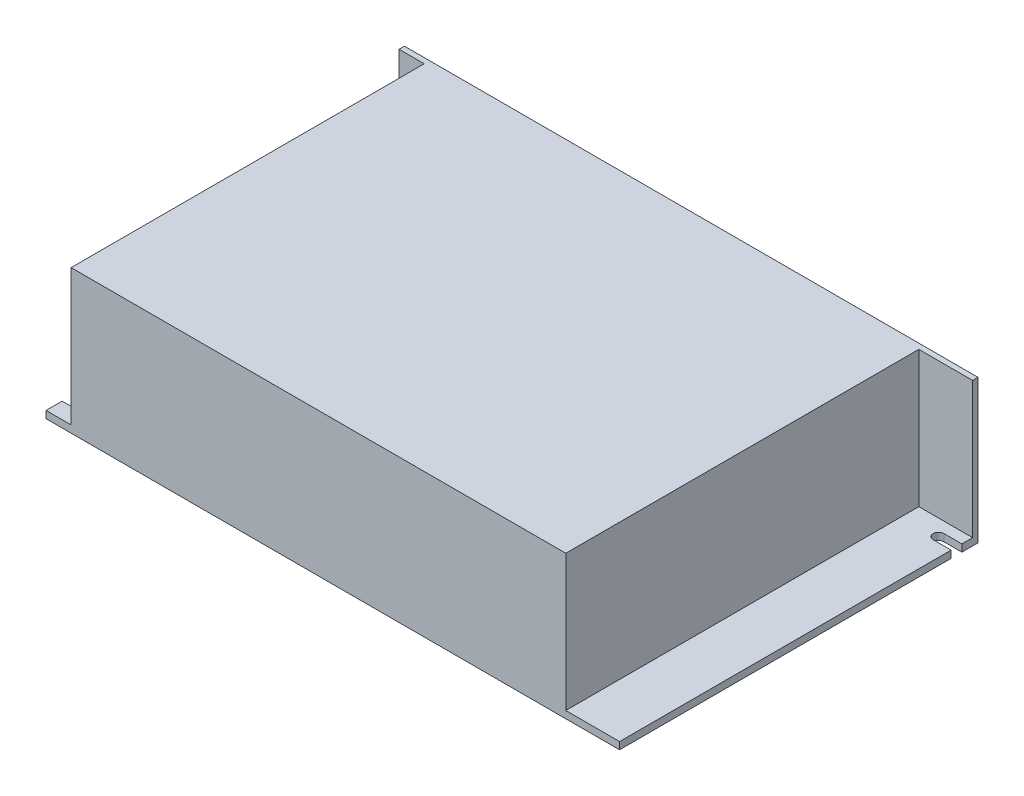
ISO-10303-21;
HEADER;
FILE_DESCRIPTION(('STEP AP214'),'2;1');
FILE_NAME('part.step','',(''),(''),'','','');
FILE_SCHEMA(('AUTOMOTIVE_DESIGN { 1 0 10303 214 1 1 1 1 }'));
ENDSEC;
DATA;
#1=APPLICATION_CONTEXT('core data for automotive mechanical design processes');
#2=APPLICATION_PROTOCOL_DEFINITION('international standard','automotive_design',2000,#1);
#3=PRODUCT_CONTEXT('',#1,'mechanical');
#4=PRODUCT('Part','Part','',(#3));
#5=PRODUCT_RELATED_PRODUCT_CATEGORY('part','',(#4));
#6=PRODUCT_DEFINITION_FORMATION('','',#4);
#7=PRODUCT_DEFINITION_CONTEXT('part definition',#1,'design');
#8=PRODUCT_DEFINITION('design','',#6,#7);
#9=PRODUCT_DEFINITION_SHAPE('','',#8);
#10=(LENGTH_UNIT() NAMED_UNIT(*) SI_UNIT(.MILLI.,.METRE.));
#11=(NAMED_UNIT(*) PLANE_ANGLE_UNIT() SI_UNIT($,.RADIAN.));
#12=(NAMED_UNIT(*) SI_UNIT($,.STERADIAN.) SOLID_ANGLE_UNIT());
#13=UNCERTAINTY_MEASURE_WITH_UNIT(LENGTH_MEASURE(1.E-05),#10,'distance_accuracy_value','');
#14=(GEOMETRIC_REPRESENTATION_CONTEXT(3) GLOBAL_UNCERTAINTY_ASSIGNED_CONTEXT((#13)) GLOBAL_UNIT_ASSIGNED_CONTEXT((#10,
#11,#12)) REPRESENTATION_CONTEXT('',''));
#15=CARTESIAN_POINT('',(0.,0.,0.));
#16=DIRECTION('',(0.,0.,1.));
#17=DIRECTION('',(1.,0.,0.));
#18=AXIS2_PLACEMENT_3D('',#15,#16,#17);
#19=CARTESIAN_POINT('',(80.,-20.,100.));
#20=DIRECTION('',(-1.,0.,0.));
#21=DIRECTION('',(0.,0.,1.));
#22=AXIS2_PLACEMENT_3D('',#19,#20,#21);
#23=PLANE('',#22);
#24=DIRECTION('',(0.,0.,-1.));
#25=VECTOR('',#24,1.);
#26=CARTESIAN_POINT('',(80.,-20.,100.));
#27=LINE('',#26,#25);
#28=CARTESIAN_POINT('',(80.,-20.,100.));
#29=VERTEX_POINT('',#28);
#30=CARTESIAN_POINT('',(80.,-20.,7.5));
#31=VERTEX_POINT('',#30);
#32=EDGE_CURVE('E188',#29,#31,#27,.T.);
#33=ORIENTED_EDGE('',*,*,#32,.T.);
#34=DIRECTION('',(0.,1.,0.));
#35=VECTOR('',#34,1.);
#36=CARTESIAN_POINT('',(80.,-20.,7.5));
#37=LINE('',#36,#35);
#38=CARTESIAN_POINT('',(80.,-18.,7.5));
#39=VERTEX_POINT('',#38);
#40=EDGE_CURVE('E248',#31,#39,#37,.T.);
#41=ORIENTED_EDGE('',*,*,#40,.T.);
#42=DIRECTION('',(0.,0.,1.));
#43=VECTOR('',#42,1.);
#44=CARTESIAN_POINT('',(80.,-18.,1.5));
#45=LINE('',#44,#43);
#46=CARTESIAN_POINT('',(80.,-18.,100.));
#47=VERTEX_POINT('',#46);
#48=EDGE_CURVE('E250',#39,#47,#45,.T.);
#49=ORIENTED_EDGE('',*,*,#48,.T.);
#50=DIRECTION('',(0.,1.,0.));
#51=VECTOR('',#50,1.);
#52=CARTESIAN_POINT('',(80.,-20.,100.));
#53=LINE('',#52,#51);
#54=EDGE_CURVE('E222',#29,#47,#53,.T.);
#55=ORIENTED_EDGE('',*,*,#54,.F.);
#56=EDGE_LOOP('',(#33,#41,#49,#55));
#57=FACE_BOUND('',#56,.T.);
#58=ADVANCED_FACE('F40',(#57),#23,.F.);
#59=CARTESIAN_POINT('',(-80.,-20.,100.));
#60=DIRECTION('',(1.,0.,0.));
#61=DIRECTION('',(0.,0.,-1.));
#62=AXIS2_PLACEMENT_3D('',#59,#60,#61);
#63=PLANE('',#62);
#64=DIRECTION('',(0.,0.,-1.));
#65=VECTOR('',#64,1.);
#66=CARTESIAN_POINT('',(-80.,-20.,100.));
#67=LINE('',#66,#65);
#68=CARTESIAN_POINT('',(-80.,-20.,92.5));
#69=VERTEX_POINT('',#68);
#70=CARTESIAN_POINT('',(-80.,-20.,0.));
#71=VERTEX_POINT('',#70);
#72=EDGE_CURVE('E192',#69,#71,#67,.T.);
#73=ORIENTED_EDGE('',*,*,#72,.F.);
#74=DIRECTION('',(0.,1.,0.));
#75=VECTOR('',#74,1.);
#76=CARTESIAN_POINT('',(-80.,-20.,92.5));
#77=LINE('',#76,#75);
#78=CARTESIAN_POINT('',(-80.,-18.,92.5));
#79=VERTEX_POINT('',#78);
#80=EDGE_CURVE('E280',#69,#79,#77,.T.);
#81=ORIENTED_EDGE('',*,*,#80,.T.);
#82=DIRECTION('',(0.,0.,-1.));
#83=VECTOR('',#82,1.);
#84=CARTESIAN_POINT('',(-80.,-18.,1.5));
#85=LINE('',#84,#83);
#86=CARTESIAN_POINT('',(-80.,-18.,1.5));
#87=VERTEX_POINT('',#86);
#88=EDGE_CURVE('E270',#79,#87,#85,.T.);
#89=ORIENTED_EDGE('',*,*,#88,.T.);
#90=DIRECTION('',(0.,1.,0.));
#91=VECTOR('',#90,1.);
#92=CARTESIAN_POINT('',(-80.,-119.635586012228,1.5));
#93=LINE('',#92,#91);
#94=CARTESIAN_POINT('',(-80.,20.,1.5));
#95=VERTEX_POINT('',#94);
#96=EDGE_CURVE('E210',#87,#95,#93,.T.);
#97=ORIENTED_EDGE('',*,*,#96,.T.);
#98=DIRECTION('',(0.,0.,-1.));
#99=VECTOR('',#98,1.);
#100=CARTESIAN_POINT('',(-80.,20.,100.));
#101=LINE('',#100,#99);
#102=CARTESIAN_POINT('',(-80.,20.,0.));
#103=VERTEX_POINT('',#102);
#104=EDGE_CURVE('E48',#95,#103,#101,.T.);
#105=ORIENTED_EDGE('',*,*,#104,.T.);
#106=DIRECTION('',(0.,-1.,0.));
#107=VECTOR('',#106,1.);
#108=CARTESIAN_POINT('',(-80.,-20.,0.));
#109=LINE('',#108,#107);
#110=EDGE_CURVE('E208',#103,#71,#109,.T.);
#111=ORIENTED_EDGE('',*,*,#110,.T.);
#112=EDGE_LOOP('',(#73,#81,#89,#97,#105,#111));
#113=FACE_BOUND('',#112,.T.);
#114=ADVANCED_FACE('F206',(#113),#63,.F.);
#115=CARTESIAN_POINT('',(80.,-18.,1.5));
#116=VERTEX_POINT('',#115);
#117=CARTESIAN_POINT('',(80.,-18.,4.5));
#118=VERTEX_POINT('',#117);
#119=EDGE_CURVE('E181',#116,#118,#45,.T.);
#120=ORIENTED_EDGE('',*,*,#119,.T.);
#121=DIRECTION('',(0.,1.,0.));
#122=VECTOR('',#121,1.);
#123=CARTESIAN_POINT('',(80.,-20.,4.5));
#124=LINE('',#123,#122);
#125=CARTESIAN_POINT('',(80.,-20.,4.5));
#126=VERTEX_POINT('',#125);
#127=EDGE_CURVE('E55',#126,#118,#124,.T.);
#128=ORIENTED_EDGE('',*,*,#127,.F.);
#129=CARTESIAN_POINT('',(80.,-20.,0.));
#130=VERTEX_POINT('',#129);
#131=EDGE_CURVE('E177',#126,#130,#27,.T.);
#132=ORIENTED_EDGE('',*,*,#131,.T.);
#133=DIRECTION('',(0.,1.,0.));
#134=VECTOR('',#133,1.);
#135=CARTESIAN_POINT('',(80.,-20.,0.));
#136=LINE('',#135,#134);
#137=CARTESIAN_POINT('',(80.,20.,0.));
#138=VERTEX_POINT('',#137);
#139=EDGE_CURVE('E219',#130,#138,#136,.T.);
#140=ORIENTED_EDGE('',*,*,#139,.T.);
#141=DIRECTION('',(0.,0.,-1.));
#142=VECTOR('',#141,1.);
#143=CARTESIAN_POINT('',(80.,20.,100.));
#144=LINE('',#143,#142);
#145=CARTESIAN_POINT('',(80.,20.,1.5));
#146=VERTEX_POINT('',#145);
#147=EDGE_CURVE('E12',#146,#138,#144,.T.);
#148=ORIENTED_EDGE('',*,*,#147,.F.);
#149=DIRECTION('',(0.,1.,0.));
#150=VECTOR('',#149,1.);
#151=CARTESIAN_POINT('',(80.,-119.635586012228,1.5));
#152=LINE('',#151,#150);
#153=EDGE_CURVE('E235',#116,#146,#152,.T.);
#154=ORIENTED_EDGE('',*,*,#153,.F.);
#155=EDGE_LOOP('',(#120,#128,#132,#140,#148,#154));
#156=FACE_BOUND('',#155,.T.);
#157=ADVANCED_FACE('F42',(#156),#23,.F.);
#158=CARTESIAN_POINT('',(-80.,20.,100.));
#159=DIRECTION('',(0.,-1.,0.));
#160=DIRECTION('',(0.,0.,-1.));
#161=AXIS2_PLACEMENT_3D('',#158,#159,#160);
#162=PLANE('',#161);
#163=ORIENTED_EDGE('',*,*,#104,.F.);
#164=DIRECTION('',(-1.,0.,0.));
#165=VECTOR('',#164,1.);
#166=CARTESIAN_POINT('',(-80.,20.,1.5));
#167=LINE('',#166,#165);
#168=CARTESIAN_POINT('',(-73.,20.,1.5));
#169=VERTEX_POINT('',#168);
#170=EDGE_CURVE('E261',#169,#95,#167,.T.);
#171=ORIENTED_EDGE('',*,*,#170,.F.);
#172=DIRECTION('',(0.,0.,-1.));
#173=VECTOR('',#172,1.);
#174=CARTESIAN_POINT('',(-73.,20.,1.5));
#175=LINE('',#174,#173);
#176=CARTESIAN_POINT('',(-73.,20.,100.));
#177=VERTEX_POINT('',#176);
#178=EDGE_CURVE('E234',#177,#169,#175,.T.);
#179=ORIENTED_EDGE('',*,*,#178,.F.);
#180=DIRECTION('',(-1.,0.,0.));
#181=VECTOR('',#180,1.);
#182=CARTESIAN_POINT('',(-80.,20.,100.));
#183=LINE('',#182,#181);
#184=CARTESIAN_POINT('',(65.,20.,100.));
#185=VERTEX_POINT('',#184);
#186=EDGE_CURVE('E227',#185,#177,#183,.T.);
#187=ORIENTED_EDGE('',*,*,#186,.F.);
#188=DIRECTION('',(0.,0.,1.));
#189=VECTOR('',#188,1.);
#190=CARTESIAN_POINT('',(65.,20.,1.5));
#191=LINE('',#190,#189);
#192=CARTESIAN_POINT('',(65.,20.,1.5));
#193=VERTEX_POINT('',#192);
#194=EDGE_CURVE('E238',#193,#185,#191,.T.);
#195=ORIENTED_EDGE('',*,*,#194,.F.);
#196=DIRECTION('',(-1.,0.,0.));
#197=VECTOR('',#196,1.);
#198=CARTESIAN_POINT('',(80.,20.,1.5));
#199=LINE('',#198,#197);
#200=EDGE_CURVE('E245',#146,#193,#199,.T.);
#201=ORIENTED_EDGE('',*,*,#200,.F.);
#202=ORIENTED_EDGE('',*,*,#147,.T.);
#203=DIRECTION('',(-1.,0.,0.));
#204=VECTOR('',#203,1.);
#205=CARTESIAN_POINT('',(-80.,20.,0.));
#206=LINE('',#205,#204);
#207=EDGE_CURVE('E214',#138,#103,#206,.T.);
#208=ORIENTED_EDGE('',*,*,#207,.T.);
#209=EDGE_LOOP('',(#163,#171,#179,#187,#195,#201,#202,#208));
#210=FACE_BOUND('',#209,.T.);
#211=ADVANCED_FACE('F215',(#210),#162,.F.);
#212=CARTESIAN_POINT('',(-80.,-18.,100.));
#213=VERTEX_POINT('',#212);
#214=CARTESIAN_POINT('',(-80.,-18.,95.5));
#215=VERTEX_POINT('',#214);
#216=EDGE_CURVE('E257',#213,#215,#85,.T.);
#217=ORIENTED_EDGE('',*,*,#216,.T.);
#218=DIRECTION('',(0.,1.,0.));
#219=VECTOR('',#218,1.);
#220=CARTESIAN_POINT('',(-80.,-20.,95.5));
#221=LINE('',#220,#219);
#222=CARTESIAN_POINT('',(-80.,-20.,95.5));
#223=VERTEX_POINT('',#222);
#224=EDGE_CURVE('E63',#223,#215,#221,.T.);
#225=ORIENTED_EDGE('',*,*,#224,.F.);
#226=CARTESIAN_POINT('',(-80.,-20.,100.));
#227=VERTEX_POINT('',#226);
#228=EDGE_CURVE('E198',#227,#223,#67,.T.);
#229=ORIENTED_EDGE('',*,*,#228,.F.);
#230=DIRECTION('',(0.,-1.,0.));
#231=VECTOR('',#230,1.);
#232=CARTESIAN_POINT('',(-80.,-20.,100.));
#233=LINE('',#232,#231);
#234=EDGE_CURVE('E193',#213,#227,#233,.T.);
#235=ORIENTED_EDGE('',*,*,#234,.F.);
#236=EDGE_LOOP('',(#217,#225,#229,#235));
#237=FACE_BOUND('',#236,.T.);
#238=ADVANCED_FACE('F333',(#237),#63,.F.);
#239=CARTESIAN_POINT('',(-80.,-20.,100.));
#240=DIRECTION('',(0.,1.,0.));
#241=DIRECTION('',(0.,0.,1.));
#242=AXIS2_PLACEMENT_3D('',#239,#240,#241);
#243=PLANE('',#242);
#244=CARTESIAN_POINT('',(75.,-20.,6.));
#245=DIRECTION('',(0.,1.,0.));
#246=DIRECTION('',(0.,0.,1.));
#247=AXIS2_PLACEMENT_3D('',#244,#245,#246);
#248=CIRCLE('',#247,1.5);
#249=CARTESIAN_POINT('',(75.,-20.,4.5));
#250=VERTEX_POINT('',#249);
#251=CARTESIAN_POINT('',(75.,-20.,7.5));
#252=VERTEX_POINT('',#251);
#253=EDGE_CURVE('E171',#250,#252,#248,.T.);
#254=ORIENTED_EDGE('',*,*,#253,.T.);
#255=DIRECTION('',(1.,0.,0.));
#256=VECTOR('',#255,1.);
#257=CARTESIAN_POINT('',(75.,-20.,7.5));
#258=LINE('',#257,#256);
#259=EDGE_CURVE('E182',#252,#31,#258,.T.);
#260=ORIENTED_EDGE('',*,*,#259,.T.);
#261=ORIENTED_EDGE('',*,*,#32,.F.);
#262=DIRECTION('',(1.,0.,0.));
#263=VECTOR('',#262,1.);
#264=CARTESIAN_POINT('',(-80.,-20.,100.));
#265=LINE('',#264,#263);
#266=EDGE_CURVE('E189',#227,#29,#265,.T.);
#267=ORIENTED_EDGE('',*,*,#266,.F.);
#268=ORIENTED_EDGE('',*,*,#228,.T.);
#269=DIRECTION('',(1.,0.,0.));
#270=VECTOR('',#269,1.);
#271=CARTESIAN_POINT('',(-75.,-20.,95.5));
#272=LINE('',#271,#270);
#273=CARTESIAN_POINT('',(-75.,-20.,95.5));
#274=VERTEX_POINT('',#273);
#275=EDGE_CURVE('E286',#223,#274,#272,.T.);
#276=ORIENTED_EDGE('',*,*,#275,.T.);
#277=CARTESIAN_POINT('',(-75.,-20.,94.));
#278=DIRECTION('',(0.,1.,0.));
#279=DIRECTION('',(0.,0.,-1.));
#280=AXIS2_PLACEMENT_3D('',#277,#278,#279);
#281=CIRCLE('',#280,1.5);
#282=CARTESIAN_POINT('',(-75.,-20.,92.5));
#283=VERTEX_POINT('',#282);
#284=EDGE_CURVE('E294',#274,#283,#281,.T.);
#285=ORIENTED_EDGE('',*,*,#284,.T.);
#286=DIRECTION('',(-1.,0.,0.));
#287=VECTOR('',#286,1.);
#288=CARTESIAN_POINT('',(-80.,-20.,92.5));
#289=LINE('',#288,#287);
#290=EDGE_CURVE('E276',#283,#69,#289,.T.);
#291=ORIENTED_EDGE('',*,*,#290,.T.);
#292=ORIENTED_EDGE('',*,*,#72,.T.);
#293=DIRECTION('',(1.,0.,0.));
#294=VECTOR('',#293,1.);
#295=CARTESIAN_POINT('',(-80.,-20.,0.));
#296=LINE('',#295,#294);
#297=EDGE_CURVE('E186',#71,#130,#296,.T.);
#298=ORIENTED_EDGE('',*,*,#297,.T.);
#299=ORIENTED_EDGE('',*,*,#131,.F.);
#300=DIRECTION('',(-1.,0.,0.));
#301=VECTOR('',#300,1.);
#302=CARTESIAN_POINT('',(80.,-20.,4.5));
#303=LINE('',#302,#301);
#304=EDGE_CURVE('E164',#126,#250,#303,.T.);
#305=ORIENTED_EDGE('',*,*,#304,.T.);
#306=EDGE_LOOP('',(#254,#260,#261,#267,#268,#276,#285,#291,#292,#298,#299,#305));
#307=FACE_BOUND('',#306,.T.);
#308=ADVANCED_FACE('F184',(#307),#243,.F.);
#309=CARTESIAN_POINT('',(0.,0.,100.));
#310=DIRECTION('',(0.,0.,-1.));
#311=DIRECTION('',(-1.,0.,0.));
#312=AXIS2_PLACEMENT_3D('',#309,#310,#311);
#313=PLANE('',#312);
#314=ORIENTED_EDGE('',*,*,#186,.T.);
#315=DIRECTION('',(0.,1.,0.));
#316=VECTOR('',#315,1.);
#317=CARTESIAN_POINT('',(-73.,-119.635586012228,100.));
#318=LINE('',#317,#316);
#319=CARTESIAN_POINT('',(-73.,-18.,100.));
#320=VERTEX_POINT('',#319);
#321=EDGE_CURVE('E258',#320,#177,#318,.T.);
#322=ORIENTED_EDGE('',*,*,#321,.F.);
#323=DIRECTION('',(-1.,0.,0.));
#324=VECTOR('',#323,1.);
#325=CARTESIAN_POINT('',(-80.,-18.,100.));
#326=LINE('',#325,#324);
#327=EDGE_CURVE('E224',#320,#213,#326,.T.);
#328=ORIENTED_EDGE('',*,*,#327,.T.);
#329=ORIENTED_EDGE('',*,*,#234,.T.);
#330=ORIENTED_EDGE('',*,*,#266,.T.);
#331=ORIENTED_EDGE('',*,*,#54,.T.);
#332=DIRECTION('',(-1.,0.,0.));
#333=VECTOR('',#332,1.);
#334=CARTESIAN_POINT('',(80.,-18.,100.));
#335=LINE('',#334,#333);
#336=CARTESIAN_POINT('',(65.,-18.,100.));
#337=VERTEX_POINT('',#336);
#338=EDGE_CURVE('E251',#47,#337,#335,.T.);
#339=ORIENTED_EDGE('',*,*,#338,.T.);
#340=DIRECTION('',(0.,1.,0.));
#341=VECTOR('',#340,1.);
#342=CARTESIAN_POINT('',(65.,-119.635586012228,100.));
#343=LINE('',#342,#341);
#344=EDGE_CURVE('E240',#337,#185,#343,.T.);
#345=ORIENTED_EDGE('',*,*,#344,.T.);
#346=EDGE_LOOP('',(#314,#322,#328,#329,#330,#331,#339,#345));
#347=FACE_BOUND('',#346,.T.);
#348=ADVANCED_FACE('F328',(#347),#313,.F.);
#349=CARTESIAN_POINT('',(0.,0.,0.));
#350=DIRECTION('',(0.,0.,-1.));
#351=DIRECTION('',(-1.,0.,0.));
#352=AXIS2_PLACEMENT_3D('',#349,#350,#351);
#353=PLANE('',#352);
#354=ORIENTED_EDGE('',*,*,#139,.F.);
#355=ORIENTED_EDGE('',*,*,#297,.F.);
#356=ORIENTED_EDGE('',*,*,#110,.F.);
#357=ORIENTED_EDGE('',*,*,#207,.F.);
#358=EDGE_LOOP('',(#354,#355,#356,#357));
#359=FACE_BOUND('',#358,.T.);
#360=ADVANCED_FACE('F221',(#359),#353,.T.);
#361=CARTESIAN_POINT('',(65.,-119.635586012228,1.5));
#362=DIRECTION('',(-1.,0.,0.));
#363=DIRECTION('',(0.,0.,1.));
#364=AXIS2_PLACEMENT_3D('',#361,#362,#363);
#365=PLANE('',#364);
#366=DIRECTION('',(0.,0.,-1.));
#367=VECTOR('',#366,1.);
#368=CARTESIAN_POINT('',(65.,-18.,1.5));
#369=LINE('',#368,#367);
#370=CARTESIAN_POINT('',(65.,-18.,1.5));
#371=VERTEX_POINT('',#370);
#372=EDGE_CURVE('E243',#337,#371,#369,.T.);
#373=ORIENTED_EDGE('',*,*,#372,.T.);
#374=DIRECTION('',(0.,1.,0.));
#375=VECTOR('',#374,1.);
#376=CARTESIAN_POINT('',(65.,-119.635586012228,1.5));
#377=LINE('',#376,#375);
#378=EDGE_CURVE('E237',#371,#193,#377,.T.);
#379=ORIENTED_EDGE('',*,*,#378,.T.);
#380=ORIENTED_EDGE('',*,*,#194,.T.);
#381=ORIENTED_EDGE('',*,*,#344,.F.);
#382=EDGE_LOOP('',(#373,#379,#380,#381));
#383=FACE_BOUND('',#382,.T.);
#384=ADVANCED_FACE('F387',(#383),#365,.F.);
#385=CARTESIAN_POINT('',(80.,-119.635586012228,1.5));
#386=DIRECTION('',(0.,0.,-1.));
#387=DIRECTION('',(-1.,0.,0.));
#388=AXIS2_PLACEMENT_3D('',#385,#386,#387);
#389=PLANE('',#388);
#390=DIRECTION('',(1.,0.,0.));
#391=VECTOR('',#390,1.);
#392=CARTESIAN_POINT('',(80.,-18.,1.5));
#393=LINE('',#392,#391);
#394=EDGE_CURVE('E232',#371,#116,#393,.T.);
#395=ORIENTED_EDGE('',*,*,#394,.T.);
#396=ORIENTED_EDGE('',*,*,#153,.T.);
#397=ORIENTED_EDGE('',*,*,#200,.T.);
#398=ORIENTED_EDGE('',*,*,#378,.F.);
#399=EDGE_LOOP('',(#395,#396,#397,#398));
#400=FACE_BOUND('',#399,.T.);
#401=ADVANCED_FACE('F389',(#400),#389,.F.);
#402=CARTESIAN_POINT('',(-80.,-18.,100.));
#403=DIRECTION('',(0.,1.,0.));
#404=DIRECTION('',(0.,0.,1.));
#405=AXIS2_PLACEMENT_3D('',#402,#403,#404);
#406=PLANE('',#405);
#407=DIRECTION('',(1.,0.,0.));
#408=VECTOR('',#407,1.);
#409=CARTESIAN_POINT('',(75.,-18.,7.5));
#410=LINE('',#409,#408);
#411=CARTESIAN_POINT('',(75.,-18.,7.5));
#412=VERTEX_POINT('',#411);
#413=EDGE_CURVE('E172',#412,#39,#410,.T.);
#414=ORIENTED_EDGE('',*,*,#413,.F.);
#415=CARTESIAN_POINT('',(75.,-18.,6.));
#416=DIRECTION('',(0.,1.,0.));
#417=DIRECTION('',(0.,0.,1.));
#418=AXIS2_PLACEMENT_3D('',#415,#416,#417);
#419=CIRCLE('',#418,1.5);
#420=CARTESIAN_POINT('',(75.,-18.,4.5));
#421=VERTEX_POINT('',#420);
#422=EDGE_CURVE('E305',#421,#412,#419,.T.);
#423=ORIENTED_EDGE('',*,*,#422,.F.);
#424=DIRECTION('',(-1.,0.,0.));
#425=VECTOR('',#424,1.);
#426=CARTESIAN_POINT('',(80.,-18.,4.5));
#427=LINE('',#426,#425);
#428=EDGE_CURVE('E283',#118,#421,#427,.T.);
#429=ORIENTED_EDGE('',*,*,#428,.F.);
#430=ORIENTED_EDGE('',*,*,#119,.F.);
#431=ORIENTED_EDGE('',*,*,#394,.F.);
#432=ORIENTED_EDGE('',*,*,#372,.F.);
#433=ORIENTED_EDGE('',*,*,#338,.F.);
#434=ORIENTED_EDGE('',*,*,#48,.F.);
#435=EDGE_LOOP('',(#414,#423,#429,#430,#431,#432,#433,#434));
#436=FACE_BOUND('',#435,.T.);
#437=ADVANCED_FACE('F324',(#436),#406,.T.);
#438=CARTESIAN_POINT('',(-80.,-119.635586012228,1.5));
#439=DIRECTION('',(0.,0.,-1.));
#440=DIRECTION('',(-1.,0.,0.));
#441=AXIS2_PLACEMENT_3D('',#438,#439,#440);
#442=PLANE('',#441);
#443=DIRECTION('',(1.,0.,0.));
#444=VECTOR('',#443,1.);
#445=CARTESIAN_POINT('',(-80.,-18.,1.5));
#446=LINE('',#445,#444);
#447=CARTESIAN_POINT('',(-73.,-18.,1.5));
#448=VERTEX_POINT('',#447);
#449=EDGE_CURVE('E271',#87,#448,#446,.T.);
#450=ORIENTED_EDGE('',*,*,#449,.T.);
#451=DIRECTION('',(0.,1.,0.));
#452=VECTOR('',#451,1.);
#453=CARTESIAN_POINT('',(-73.,-119.635586012228,1.5));
#454=LINE('',#453,#452);
#455=EDGE_CURVE('E260',#448,#169,#454,.T.);
#456=ORIENTED_EDGE('',*,*,#455,.T.);
#457=ORIENTED_EDGE('',*,*,#170,.T.);
#458=ORIENTED_EDGE('',*,*,#96,.F.);
#459=EDGE_LOOP('',(#450,#456,#457,#458));
#460=FACE_BOUND('',#459,.T.);
#461=ADVANCED_FACE('F348',(#460),#442,.F.);
#462=CARTESIAN_POINT('',(-73.,-119.635586012228,1.5));
#463=DIRECTION('',(1.,0.,0.));
#464=DIRECTION('',(0.,0.,-1.));
#465=AXIS2_PLACEMENT_3D('',#462,#463,#464);
#466=PLANE('',#465);
#467=DIRECTION('',(0.,0.,1.));
#468=VECTOR('',#467,1.);
#469=CARTESIAN_POINT('',(-73.,-18.,1.5));
#470=LINE('',#469,#468);
#471=EDGE_CURVE('E264',#448,#320,#470,.T.);
#472=ORIENTED_EDGE('',*,*,#471,.T.);
#473=ORIENTED_EDGE('',*,*,#321,.T.);
#474=ORIENTED_EDGE('',*,*,#178,.T.);
#475=ORIENTED_EDGE('',*,*,#455,.F.);
#476=EDGE_LOOP('',(#472,#473,#474,#475));
#477=FACE_BOUND('',#476,.T.);
#478=ADVANCED_FACE('F344',(#477),#466,.F.);
#479=CARTESIAN_POINT('',(-80.,-18.,100.));
#480=DIRECTION('',(0.,1.,0.));
#481=DIRECTION('',(0.,0.,1.));
#482=AXIS2_PLACEMENT_3D('',#479,#480,#481);
#483=PLANE('',#482);
#484=DIRECTION('',(-1.,0.,0.));
#485=VECTOR('',#484,1.);
#486=CARTESIAN_POINT('',(-80.,-18.,92.5));
#487=LINE('',#486,#485);
#488=CARTESIAN_POINT('',(-75.,-18.,92.5));
#489=VERTEX_POINT('',#488);
#490=EDGE_CURVE('E284',#489,#79,#487,.T.);
#491=ORIENTED_EDGE('',*,*,#490,.F.);
#492=CARTESIAN_POINT('',(-75.,-18.,94.));
#493=DIRECTION('',(0.,1.,0.));
#494=DIRECTION('',(0.,0.,-1.));
#495=AXIS2_PLACEMENT_3D('',#492,#493,#494);
#496=CIRCLE('',#495,1.5);
#497=CARTESIAN_POINT('',(-75.,-18.,95.5));
#498=VERTEX_POINT('',#497);
#499=EDGE_CURVE('E287',#498,#489,#496,.T.);
#500=ORIENTED_EDGE('',*,*,#499,.F.);
#501=DIRECTION('',(1.,0.,0.));
#502=VECTOR('',#501,1.);
#503=CARTESIAN_POINT('',(-75.,-18.,95.5));
#504=LINE('',#503,#502);
#505=EDGE_CURVE('E290',#215,#498,#504,.T.);
#506=ORIENTED_EDGE('',*,*,#505,.F.);
#507=ORIENTED_EDGE('',*,*,#216,.F.);
#508=ORIENTED_EDGE('',*,*,#327,.F.);
#509=ORIENTED_EDGE('',*,*,#471,.F.);
#510=ORIENTED_EDGE('',*,*,#449,.F.);
#511=ORIENTED_EDGE('',*,*,#88,.F.);
#512=EDGE_LOOP('',(#491,#500,#506,#507,#508,#509,#510,#511));
#513=FACE_BOUND('',#512,.T.);
#514=ADVANCED_FACE('F337',(#513),#483,.T.);
#515=CARTESIAN_POINT('',(-80.,-20.,92.5));
#516=DIRECTION('',(0.,0.,-1.));
#517=DIRECTION('',(-1.,0.,0.));
#518=AXIS2_PLACEMENT_3D('',#515,#516,#517);
#519=PLANE('',#518);
#520=ORIENTED_EDGE('',*,*,#490,.T.);
#521=ORIENTED_EDGE('',*,*,#80,.F.);
#522=ORIENTED_EDGE('',*,*,#290,.F.);
#523=DIRECTION('',(0.,1.,0.));
#524=VECTOR('',#523,1.);
#525=CARTESIAN_POINT('',(-75.,-20.,92.5));
#526=LINE('',#525,#524);
#527=EDGE_CURVE('E278',#283,#489,#526,.T.);
#528=ORIENTED_EDGE('',*,*,#527,.T.);
#529=EDGE_LOOP('',(#520,#521,#522,#528));
#530=FACE_BOUND('',#529,.T.);
#531=ADVANCED_FACE('F353',(#530),#519,.F.);
#532=CARTESIAN_POINT('',(-75.,-20.,94.));
#533=DIRECTION('',(0.,1.,0.));
#534=DIRECTION('',(0.,0.,1.));
#535=AXIS2_PLACEMENT_3D('',#532,#533,#534);
#536=CYLINDRICAL_SURFACE('',#535,1.5);
#537=ORIENTED_EDGE('',*,*,#499,.T.);
#538=ORIENTED_EDGE('',*,*,#527,.F.);
#539=ORIENTED_EDGE('',*,*,#284,.F.);
#540=DIRECTION('',(0.,1.,0.));
#541=VECTOR('',#540,1.);
#542=CARTESIAN_POINT('',(-75.,-20.,95.5));
#543=LINE('',#542,#541);
#544=EDGE_CURVE('E275',#274,#498,#543,.T.);
#545=ORIENTED_EDGE('',*,*,#544,.T.);
#546=EDGE_LOOP('',(#537,#538,#539,#545));
#547=FACE_BOUND('',#546,.T.);
#548=ADVANCED_FACE('F356',(#547),#536,.F.);
#549=CARTESIAN_POINT('',(-75.,-20.,95.5));
#550=DIRECTION('',(0.,0.,1.));
#551=DIRECTION('',(1.,0.,0.));
#552=AXIS2_PLACEMENT_3D('',#549,#550,#551);
#553=PLANE('',#552);
#554=ORIENTED_EDGE('',*,*,#505,.T.);
#555=ORIENTED_EDGE('',*,*,#544,.F.);
#556=ORIENTED_EDGE('',*,*,#275,.F.);
#557=ORIENTED_EDGE('',*,*,#224,.T.);
#558=EDGE_LOOP('',(#554,#555,#556,#557));
#559=FACE_BOUND('',#558,.T.);
#560=ADVANCED_FACE('F357',(#559),#553,.F.);
#561=CARTESIAN_POINT('',(75.,-20.,7.5));
#562=DIRECTION('',(0.,0.,1.));
#563=DIRECTION('',(1.,0.,0.));
#564=AXIS2_PLACEMENT_3D('',#561,#562,#563);
#565=PLANE('',#564);
#566=ORIENTED_EDGE('',*,*,#413,.T.);
#567=ORIENTED_EDGE('',*,*,#40,.F.);
#568=ORIENTED_EDGE('',*,*,#259,.F.);
#569=DIRECTION('',(0.,1.,0.));
#570=VECTOR('',#569,1.);
#571=CARTESIAN_POINT('',(75.,-20.,7.5));
#572=LINE('',#571,#570);
#573=EDGE_CURVE('E300',#252,#412,#572,.T.);
#574=ORIENTED_EDGE('',*,*,#573,.T.);
#575=EDGE_LOOP('',(#566,#567,#568,#574));
#576=FACE_BOUND('',#575,.T.);
#577=ADVANCED_FACE('F318',(#576),#565,.F.);
#578=CARTESIAN_POINT('',(75.,-20.,6.));
#579=DIRECTION('',(0.,1.,0.));
#580=DIRECTION('',(0.,0.,1.));
#581=AXIS2_PLACEMENT_3D('',#578,#579,#580);
#582=CYLINDRICAL_SURFACE('',#581,1.5);
#583=ORIENTED_EDGE('',*,*,#422,.T.);
#584=ORIENTED_EDGE('',*,*,#573,.F.);
#585=ORIENTED_EDGE('',*,*,#253,.F.);
#586=DIRECTION('',(0.,1.,0.));
#587=VECTOR('',#586,1.);
#588=CARTESIAN_POINT('',(75.,-20.,4.5));
#589=LINE('',#588,#587);
#590=EDGE_CURVE('E166',#250,#421,#589,.T.);
#591=ORIENTED_EDGE('',*,*,#590,.T.);
#592=EDGE_LOOP('',(#583,#584,#585,#591));
#593=FACE_BOUND('',#592,.T.);
#594=ADVANCED_FACE('F314',(#593),#582,.F.);
#595=CARTESIAN_POINT('',(80.,-20.,4.5));
#596=DIRECTION('',(0.,0.,-1.));
#597=DIRECTION('',(-1.,0.,0.));
#598=AXIS2_PLACEMENT_3D('',#595,#596,#597);
#599=PLANE('',#598);
#600=ORIENTED_EDGE('',*,*,#428,.T.);
#601=ORIENTED_EDGE('',*,*,#590,.F.);
#602=ORIENTED_EDGE('',*,*,#304,.F.);
#603=ORIENTED_EDGE('',*,*,#127,.T.);
#604=EDGE_LOOP('',(#600,#601,#602,#603));
#605=FACE_BOUND('',#604,.T.);
#606=ADVANCED_FACE('F165',(#605),#599,.F.);
#607=CLOSED_SHELL('',(#58,#114,#157,#211,#238,#308,#348,#360,#384,#401,#437,#461,#478,#514,#531,
#548,#560,#577,#594,#606));
#608=MANIFOLD_SOLID_BREP('B2',#607);
#609=ADVANCED_BREP_SHAPE_REPRESENTATION('',(#18,#608),#14);
#610=SHAPE_DEFINITION_REPRESENTATION(#9,#609);
ENDSEC;
END-ISO-10303-21;
